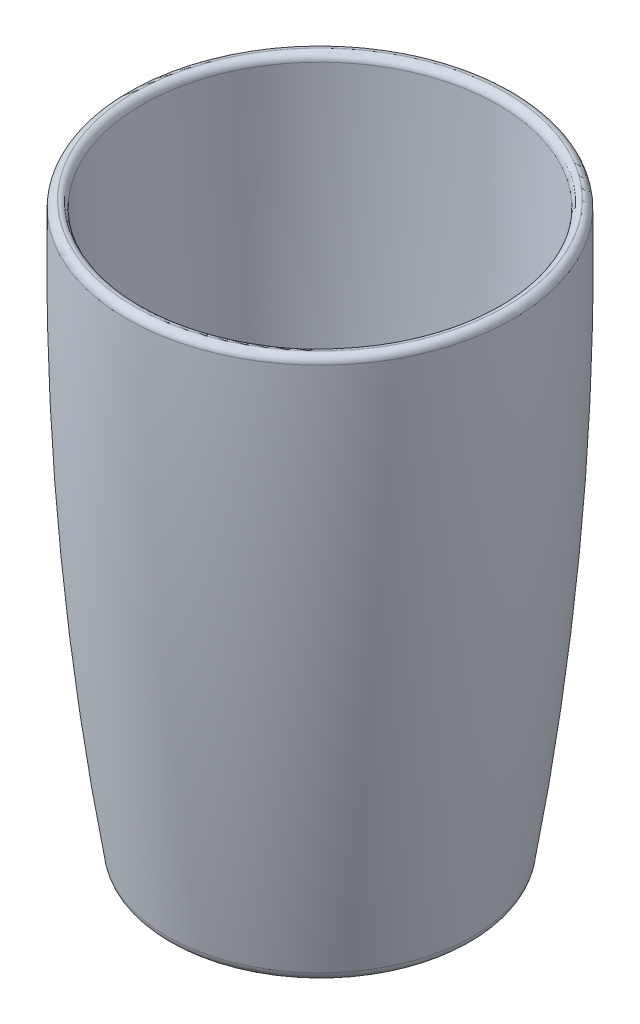
ISO-10303-21;
HEADER;
FILE_DESCRIPTION(('STEP AP214'),'2;1');
FILE_NAME('part.step','',(''),(''),'','','');
FILE_SCHEMA(('AUTOMOTIVE_DESIGN { 1 0 10303 214 1 1 1 1 }'));
ENDSEC;
DATA;
#1=APPLICATION_CONTEXT('core data for automotive mechanical design processes');
#2=APPLICATION_PROTOCOL_DEFINITION('international standard','automotive_design',2000,#1);
#3=PRODUCT_CONTEXT('',#1,'mechanical');
#4=PRODUCT('Part','Part','',(#3));
#5=PRODUCT_RELATED_PRODUCT_CATEGORY('part','',(#4));
#6=PRODUCT_DEFINITION_FORMATION('','',#4);
#7=PRODUCT_DEFINITION_CONTEXT('part definition',#1,'design');
#8=PRODUCT_DEFINITION('design','',#6,#7);
#9=PRODUCT_DEFINITION_SHAPE('','',#8);
#10=(LENGTH_UNIT() NAMED_UNIT(*) SI_UNIT(.MILLI.,.METRE.));
#11=(NAMED_UNIT(*) PLANE_ANGLE_UNIT() SI_UNIT($,.RADIAN.));
#12=(NAMED_UNIT(*) SI_UNIT($,.STERADIAN.) SOLID_ANGLE_UNIT());
#13=UNCERTAINTY_MEASURE_WITH_UNIT(LENGTH_MEASURE(1.E-05),#10,'distance_accuracy_value','');
#14=(GEOMETRIC_REPRESENTATION_CONTEXT(3) GLOBAL_UNCERTAINTY_ASSIGNED_CONTEXT((#13)) GLOBAL_UNIT_ASSIGNED_CONTEXT((#10,
#11,#12)) REPRESENTATION_CONTEXT('',''));
#15=CARTESIAN_POINT('',(0.,0.,0.));
#16=DIRECTION('',(0.,0.,1.));
#17=DIRECTION('',(1.,0.,0.));
#18=AXIS2_PLACEMENT_3D('',#15,#16,#17);
#19=CARTESIAN_POINT('',(-103.194631519441,107.843971537112,0.));
#20=DIRECTION('',(0.,-1.,0.));
#21=DIRECTION('',(0.,0.,-1.));
#22=AXIS2_PLACEMENT_3D('',#19,#20,#21);
#23=DEGENERATE_TOROIDAL_SURFACE('',#22,645.248374840569,685.969799513648,.F.);
#24=CARTESIAN_POINT('',(-103.194631519441,116.909080124469,0.));
#25=DIRECTION('',(0.,-1.,0.));
#26=DIRECTION('',(0.,0.,-1.));
#27=AXIS2_PLACEMENT_3D('',#24,#25,#26);
#28=CIRCLE('',#27,40.6615242359011);
#29=CARTESIAN_POINT('',(-103.194631519441,116.909080124469,-40.6615242359011));
#30=VERTEX_POINT('',#29);
#31=EDGE_CURVE('E10',#30,#30,#28,.T.);
#32=ORIENTED_EDGE('',*,*,#31,.T.);
#33=EDGE_LOOP('',(#32));
#34=FACE_BOUND('',#33,.T.);
#35=CARTESIAN_POINT('',(-103.194631519441,-0.00836994291170123,0.));
#36=DIRECTION('',(0.,1.,0.));
#37=DIRECTION('',(0.,0.,1.));
#38=AXIS2_PLACEMENT_3D('',#35,#36,#37);
#39=CIRCLE('',#38,32.1897686692795);
#40=CARTESIAN_POINT('',(-103.194631519441,-0.00836994291170123,32.1897686692795));
#41=VERTEX_POINT('',#40);
#42=EDGE_CURVE('E50',#41,#41,#39,.T.);
#43=ORIENTED_EDGE('',*,*,#42,.T.);
#44=EDGE_LOOP('',(#43));
#45=FACE_BOUND('',#44,.T.);
#46=ADVANCED_FACE('F30',(#34,#45),#23,.F.);
#47=CARTESIAN_POINT('',(-62.5546315194407,118.412940425174,0.));
#48=DIRECTION('',(0.,1.,0.));
#49=DIRECTION('',(0.,0.,1.));
#50=AXIS2_PLACEMENT_3D('',#47,#48,#49);
#51=PLANE('',#50);
#52=CARTESIAN_POINT('',(-103.194631519441,118.412940425174,0.));
#53=DIRECTION('',(0.,1.,0.));
#54=DIRECTION('',(0.,0.,1.));
#55=AXIS2_PLACEMENT_3D('',#52,#53,#54);
#56=CIRCLE('',#55,39.0731988285503);
#57=CARTESIAN_POINT('',(-103.194631519441,118.412940425174,39.0731988285503));
#58=VERTEX_POINT('',#57);
#59=EDGE_CURVE('E41',#58,#58,#56,.F.);
#60=ORIENTED_EDGE('',*,*,#59,.T.);
#61=EDGE_LOOP('',(#60));
#62=FACE_BOUND('',#61,.T.);
#63=CARTESIAN_POINT('',(-103.194631519441,118.412940425174,0.));
#64=DIRECTION('',(0.,1.,0.));
#65=DIRECTION('',(0.,0.,1.));
#66=AXIS2_PLACEMENT_3D('',#63,#64,#65);
#67=CIRCLE('',#66,39.1376573150342);
#68=CARTESIAN_POINT('',(-103.194631519441,118.412940425174,39.1376573150342));
#69=VERTEX_POINT('',#68);
#70=EDGE_CURVE('E45',#69,#69,#67,.T.);
#71=ORIENTED_EDGE('',*,*,#70,.T.);
#72=EDGE_LOOP('',(#71));
#73=FACE_BOUND('',#72,.T.);
#74=ADVANCED_FACE('F71',(#62,#73),#51,.T.);
#75=CARTESIAN_POINT('',(-65.602631519441,118.412940425168,0.));
#76=CARTESIAN_POINT('',(-68.9257054930324,1.0752189871966,0.));
#77=CARTESIAN_POINT('',(-72.4534779165935,1.0690654127086,0.));
#78=CARTESIAN_POINT('',(-75.9812503394155,1.06291141500898,0.));
#79=CARTESIAN_POINT('',(-79.5090227617508,1.05675713809927,0.));
#80=CARTESIAN_POINT('',(-83.0367951837821,1.05060268688258,0.));
#81=CARTESIAN_POINT('',(-86.5645676056384,1.0444481354235,0.));
#82=CARTESIAN_POINT('',(-90.0923400274078,1.03829353409531,0.));
#83=CARTESIAN_POINT('',(-93.6201124491464,1.03213891516625,0.));
#84=CARTESIAN_POINT('',(-97.1478848708852,1.02598429623719,0.));
#85=B_SPLINE_CURVE_WITH_KNOTS('',9,(#75,#76,#77,#78,#79,#80,#81,#82,#83,#84),.UNSPECIFIED.,.F.,
.F.,(10,10),(0.0899003754072778,0.988904132715049),.UNSPECIFIED.);
#86=CARTESIAN_POINT('',(-103.194631519441,-2.14901570376958,0.));
#87=DIRECTION('',(0.,-1.,0.));
#88=AXIS1_PLACEMENT('',#86,#87);
#89=SURFACE_OF_REVOLUTION('',#85,#88);
#90=CARTESIAN_POINT('',(-103.194631519441,116.932603079995,0.));
#91=DIRECTION('',(0.,-1.,0.));
#92=DIRECTION('',(0.,0.,-1.));
#93=AXIS2_PLACEMENT_3D('',#90,#91,#92);
#94=CIRCLE('',#93,37.5498244252686);
#95=CARTESIAN_POINT('',(-103.194631519441,116.932603079995,-37.5498244252686));
#96=VERTEX_POINT('',#95);
#97=EDGE_CURVE('E37',#96,#96,#94,.F.);
#98=ORIENTED_EDGE('',*,*,#97,.T.);
#99=EDGE_LOOP('',(#98));
#100=FACE_BOUND('',#99,.T.);
#101=CARTESIAN_POINT('',(-103.194631519441,1.02598429623719,0.));
#102=DIRECTION('',(0.,-1.,0.));
#103=DIRECTION('',(0.,0.,-1.));
#104=AXIS2_PLACEMENT_3D('',#101,#102,#103);
#105=CIRCLE('',#104,6.04674664855556);
#106=CARTESIAN_POINT('',(-103.194631519441,1.02598429623719,-6.04674664855556));
#107=VERTEX_POINT('',#106);
#108=EDGE_CURVE('E56',#107,#107,#105,.T.);
#109=ORIENTED_EDGE('',*,*,#108,.T.);
#110=EDGE_LOOP('',(#109));
#111=FACE_BOUND('',#110,.T.);
#112=ADVANCED_FACE('F66',(#100,#111),#89,.F.);
#113=CARTESIAN_POINT('',(-97.1478848708851,1.02598429623381,0.));
#114=DIRECTION('',(0.,1.,0.));
#115=DIRECTION('',(0.,0.,1.));
#116=AXIS2_PLACEMENT_3D('',#113,#114,#115);
#117=PLANE('',#116);
#118=ORIENTED_EDGE('',*,*,#108,.F.);
#119=EDGE_LOOP('',(#118));
#120=FACE_BOUND('',#119,.T.);
#121=ADVANCED_FACE('F70',(#120),#117,.T.);
#122=CARTESIAN_POINT('',(-103.194631519441,-2.14901570376958,0.));
#123=DIRECTION('',(0.,-1.,0.));
#124=DIRECTION('',(0.,0.,-1.));
#125=AXIS2_PLACEMENT_3D('',#122,#123,#124);
#126=PLANE('',#125);
#127=CARTESIAN_POINT('',(-103.194631519441,-2.14901570376958,0.));
#128=DIRECTION('',(0.,-1.,0.));
#129=DIRECTION('',(0.,0.,-1.));
#130=AXIS2_PLACEMENT_3D('',#127,#128,#129);
#131=CIRCLE('',#130,29.681359573522);
#132=CARTESIAN_POINT('',(-103.194631519441,-2.14901570376958,-29.681359573522));
#133=VERTEX_POINT('',#132);
#134=EDGE_CURVE('E53',#133,#133,#131,.T.);
#135=ORIENTED_EDGE('',*,*,#134,.T.);
#136=EDGE_LOOP('',(#135));
#137=FACE_BOUND('',#136,.T.);
#138=ADVANCED_FACE('F81',(#137),#126,.T.);
#139=CARTESIAN_POINT('',(-103.194631519441,0.390984296230426,0.));
#140=DIRECTION('',(0.,-1.,0.));
#141=DIRECTION('',(0.,0.,-1.));
#142=AXIS2_PLACEMENT_3D('',#139,#140,#141);
#143=TOROIDAL_SURFACE('',#142,29.681359573522,2.54);
#144=ORIENTED_EDGE('',*,*,#42,.F.);
#145=EDGE_LOOP('',(#144));
#146=FACE_BOUND('',#145,.T.);
#147=ORIENTED_EDGE('',*,*,#134,.F.);
#148=EDGE_LOOP('',(#147));
#149=FACE_BOUND('',#148,.T.);
#150=ADVANCED_FACE('F78',(#146,#149),#143,.T.);
#151=CARTESIAN_POINT('',(-103.194631519441,116.888940425174,0.));
#152=DIRECTION('',(0.,-1.,0.));
#153=DIRECTION('',(0.,0.,-1.));
#154=AXIS2_PLACEMENT_3D('',#151,#152,#153);
#155=TOROIDAL_SURFACE('',#154,39.0731988285503,1.524);
#156=ORIENTED_EDGE('',*,*,#97,.F.);
#157=EDGE_LOOP('',(#156));
#158=FACE_BOUND('',#157,.T.);
#159=ORIENTED_EDGE('',*,*,#59,.F.);
#160=EDGE_LOOP('',(#159));
#161=FACE_BOUND('',#160,.T.);
#162=ADVANCED_FACE('F80',(#158,#161),#155,.T.);
#163=CARTESIAN_POINT('',(-103.194631519441,116.888940425174,0.));
#164=DIRECTION('',(0.,1.,0.));
#165=DIRECTION('',(0.,0.,1.));
#166=AXIS2_PLACEMENT_3D('',#163,#164,#165);
#167=TOROIDAL_SURFACE('',#166,39.1376573150342,1.524);
#168=ORIENTED_EDGE('',*,*,#70,.F.);
#169=EDGE_LOOP('',(#168));
#170=FACE_BOUND('',#169,.T.);
#171=ORIENTED_EDGE('',*,*,#31,.F.);
#172=EDGE_LOOP('',(#171));
#173=FACE_BOUND('',#172,.T.);
#174=ADVANCED_FACE('F32',(#170,#173),#167,.T.);
#175=CLOSED_SHELL('',(#46,#74,#112,#121,#138,#150,#162,#174));
#176=MANIFOLD_SOLID_BREP('B2',#175);
#177=ADVANCED_BREP_SHAPE_REPRESENTATION('',(#18,#176),#14);
#178=SHAPE_DEFINITION_REPRESENTATION(#9,#177);
ENDSEC;
END-ISO-10303-21;
